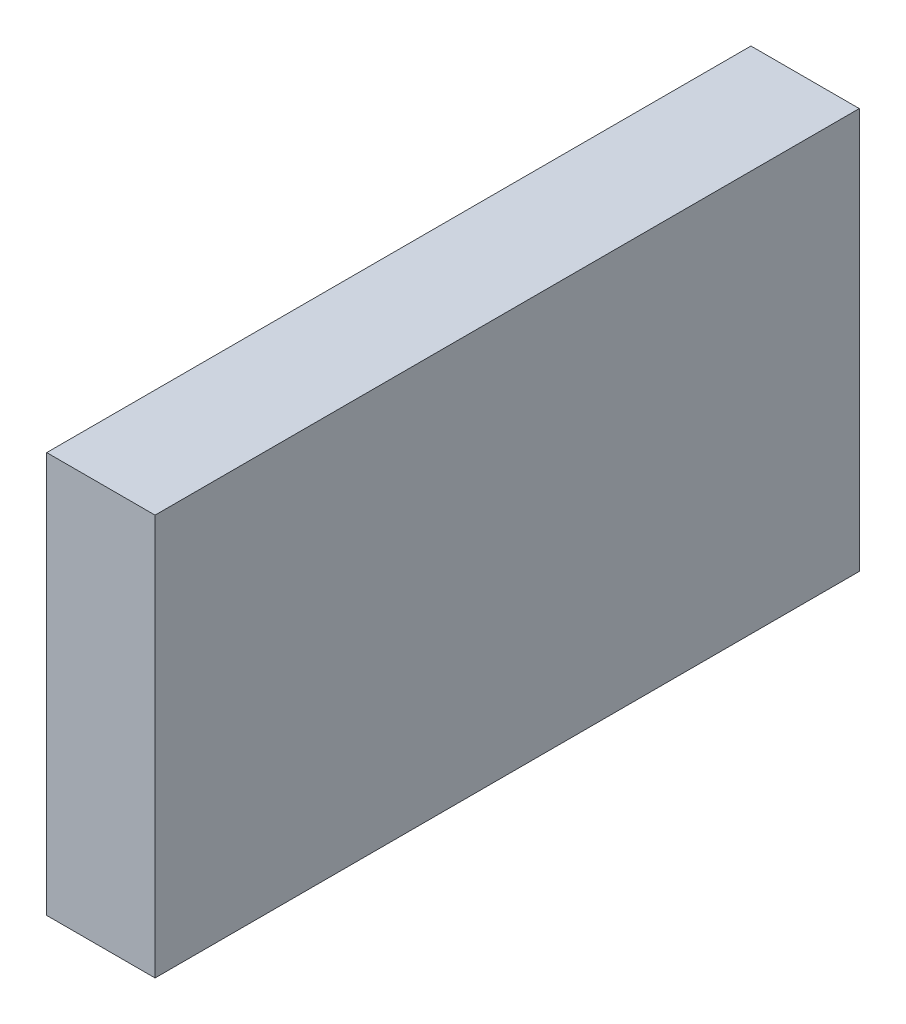
ISO-10303-21;
HEADER;
FILE_DESCRIPTION(('STEP AP214'),'2;1');
FILE_NAME('part.step','',(''),(''),'','','');
FILE_SCHEMA(('AUTOMOTIVE_DESIGN { 1 0 10303 214 1 1 1 1 }'));
ENDSEC;
DATA;
#1=APPLICATION_CONTEXT('core data for automotive mechanical design processes');
#2=APPLICATION_PROTOCOL_DEFINITION('international standard','automotive_design',2000,#1);
#3=PRODUCT_CONTEXT('',#1,'mechanical');
#4=PRODUCT('Part','Part','',(#3));
#5=PRODUCT_RELATED_PRODUCT_CATEGORY('part','',(#4));
#6=PRODUCT_DEFINITION_FORMATION('','',#4);
#7=PRODUCT_DEFINITION_CONTEXT('part definition',#1,'design');
#8=PRODUCT_DEFINITION('design','',#6,#7);
#9=PRODUCT_DEFINITION_SHAPE('','',#8);
#10=(LENGTH_UNIT() NAMED_UNIT(*) SI_UNIT(.MILLI.,.METRE.));
#11=(NAMED_UNIT(*) PLANE_ANGLE_UNIT() SI_UNIT($,.RADIAN.));
#12=(NAMED_UNIT(*) SI_UNIT($,.STERADIAN.) SOLID_ANGLE_UNIT());
#13=UNCERTAINTY_MEASURE_WITH_UNIT(LENGTH_MEASURE(1.E-05),#10,'distance_accuracy_value','');
#14=(GEOMETRIC_REPRESENTATION_CONTEXT(3) GLOBAL_UNCERTAINTY_ASSIGNED_CONTEXT((#13)) GLOBAL_UNIT_ASSIGNED_CONTEXT((#10,
#11,#12)) REPRESENTATION_CONTEXT('',''));
#15=CARTESIAN_POINT('',(0.,0.,0.));
#16=DIRECTION('',(0.,0.,1.));
#17=DIRECTION('',(1.,0.,0.));
#18=AXIS2_PLACEMENT_3D('',#15,#16,#17);
#19=CARTESIAN_POINT('',(0.,0.,33.02));
#20=DIRECTION('',(1.,0.,0.));
#21=DIRECTION('',(0.,0.,-1.));
#22=AXIS2_PLACEMENT_3D('',#19,#20,#21);
#23=PLANE('',#22);
#24=DIRECTION('',(0.,-1.,0.));
#25=VECTOR('',#24,1.);
#26=CARTESIAN_POINT('',(0.,0.,0.));
#27=LINE('',#26,#25);
#28=CARTESIAN_POINT('',(0.,18.796,0.));
#29=VERTEX_POINT('',#28);
#30=CARTESIAN_POINT('',(0.,0.,0.));
#31=VERTEX_POINT('',#30);
#32=EDGE_CURVE('E100',#29,#31,#27,.T.);
#33=ORIENTED_EDGE('',*,*,#32,.T.);
#34=DIRECTION('',(0.,0.,-1.));
#35=VECTOR('',#34,1.);
#36=CARTESIAN_POINT('',(0.,0.,33.02));
#37=LINE('',#36,#35);
#38=CARTESIAN_POINT('',(0.,0.,33.02));
#39=VERTEX_POINT('',#38);
#40=EDGE_CURVE('E11',#39,#31,#37,.T.);
#41=ORIENTED_EDGE('',*,*,#40,.F.);
#42=DIRECTION('',(0.,-1.,0.));
#43=VECTOR('',#42,1.);
#44=CARTESIAN_POINT('',(0.,0.,33.02));
#45=LINE('',#44,#43);
#46=CARTESIAN_POINT('',(0.,18.796,33.02));
#47=VERTEX_POINT('',#46);
#48=EDGE_CURVE('E88',#47,#39,#45,.T.);
#49=ORIENTED_EDGE('',*,*,#48,.F.);
#50=DIRECTION('',(0.,0.,-1.));
#51=VECTOR('',#50,1.);
#52=CARTESIAN_POINT('',(0.,18.796,33.02));
#53=LINE('',#52,#51);
#54=EDGE_CURVE('E96',#47,#29,#53,.T.);
#55=ORIENTED_EDGE('',*,*,#54,.T.);
#56=EDGE_LOOP('',(#33,#41,#49,#55));
#57=FACE_BOUND('',#56,.T.);
#58=ADVANCED_FACE('F37',(#57),#23,.F.);
#59=CARTESIAN_POINT('',(0.,0.,33.02));
#60=DIRECTION('',(0.,1.,0.));
#61=DIRECTION('',(0.,0.,1.));
#62=AXIS2_PLACEMENT_3D('',#59,#60,#61);
#63=PLANE('',#62);
#64=DIRECTION('',(1.,0.,0.));
#65=VECTOR('',#64,1.);
#66=CARTESIAN_POINT('',(0.,0.,0.));
#67=LINE('',#66,#65);
#68=CARTESIAN_POINT('',(5.08,0.,0.));
#69=VERTEX_POINT('',#68);
#70=EDGE_CURVE('E92',#31,#69,#67,.T.);
#71=ORIENTED_EDGE('',*,*,#70,.T.);
#72=DIRECTION('',(0.,0.,-1.));
#73=VECTOR('',#72,1.);
#74=CARTESIAN_POINT('',(5.08,0.,33.02));
#75=LINE('',#74,#73);
#76=CARTESIAN_POINT('',(5.08,0.,33.02));
#77=VERTEX_POINT('',#76);
#78=EDGE_CURVE('E45',#77,#69,#75,.T.);
#79=ORIENTED_EDGE('',*,*,#78,.F.);
#80=DIRECTION('',(1.,0.,0.));
#81=VECTOR('',#80,1.);
#82=CARTESIAN_POINT('',(0.,0.,33.02));
#83=LINE('',#82,#81);
#84=EDGE_CURVE('E83',#39,#77,#83,.T.);
#85=ORIENTED_EDGE('',*,*,#84,.F.);
#86=ORIENTED_EDGE('',*,*,#40,.T.);
#87=EDGE_LOOP('',(#71,#79,#85,#86));
#88=FACE_BOUND('',#87,.T.);
#89=ADVANCED_FACE('F91',(#88),#63,.F.);
#90=CARTESIAN_POINT('',(5.08,0.,33.02));
#91=DIRECTION('',(-1.,0.,0.));
#92=DIRECTION('',(0.,0.,1.));
#93=AXIS2_PLACEMENT_3D('',#90,#91,#92);
#94=PLANE('',#93);
#95=DIRECTION('',(0.,1.,0.));
#96=VECTOR('',#95,1.);
#97=CARTESIAN_POINT('',(5.08,0.,0.));
#98=LINE('',#97,#96);
#99=CARTESIAN_POINT('',(5.08,18.796,0.));
#100=VERTEX_POINT('',#99);
#101=EDGE_CURVE('E70',#69,#100,#98,.T.);
#102=ORIENTED_EDGE('',*,*,#101,.T.);
#103=DIRECTION('',(0.,0.,-1.));
#104=VECTOR('',#103,1.);
#105=CARTESIAN_POINT('',(5.08,18.796,33.02));
#106=LINE('',#105,#104);
#107=CARTESIAN_POINT('',(5.08,18.796,33.02));
#108=VERTEX_POINT('',#107);
#109=EDGE_CURVE('E93',#108,#100,#106,.T.);
#110=ORIENTED_EDGE('',*,*,#109,.F.);
#111=DIRECTION('',(0.,1.,0.));
#112=VECTOR('',#111,1.);
#113=CARTESIAN_POINT('',(5.08,0.,33.02));
#114=LINE('',#113,#112);
#115=EDGE_CURVE('E86',#77,#108,#114,.T.);
#116=ORIENTED_EDGE('',*,*,#115,.F.);
#117=ORIENTED_EDGE('',*,*,#78,.T.);
#118=EDGE_LOOP('',(#102,#110,#116,#117));
#119=FACE_BOUND('',#118,.T.);
#120=ADVANCED_FACE('F94',(#119),#94,.F.);
#121=CARTESIAN_POINT('',(0.,18.796,33.02));
#122=DIRECTION('',(0.,-1.,0.));
#123=DIRECTION('',(0.,0.,-1.));
#124=AXIS2_PLACEMENT_3D('',#121,#122,#123);
#125=PLANE('',#124);
#126=DIRECTION('',(-1.,0.,0.));
#127=VECTOR('',#126,1.);
#128=CARTESIAN_POINT('',(0.,18.796,0.));
#129=LINE('',#128,#127);
#130=EDGE_CURVE('E76',#100,#29,#129,.T.);
#131=ORIENTED_EDGE('',*,*,#130,.T.);
#132=ORIENTED_EDGE('',*,*,#54,.F.);
#133=DIRECTION('',(-1.,0.,0.));
#134=VECTOR('',#133,1.);
#135=CARTESIAN_POINT('',(0.,18.796,33.02));
#136=LINE('',#135,#134);
#137=EDGE_CURVE('E53',#108,#47,#136,.T.);
#138=ORIENTED_EDGE('',*,*,#137,.F.);
#139=ORIENTED_EDGE('',*,*,#109,.T.);
#140=EDGE_LOOP('',(#131,#132,#138,#139));
#141=FACE_BOUND('',#140,.T.);
#142=ADVANCED_FACE('F107',(#141),#125,.F.);
#143=CARTESIAN_POINT('',(0.,0.,33.02));
#144=DIRECTION('',(0.,0.,-1.));
#145=DIRECTION('',(-1.,0.,0.));
#146=AXIS2_PLACEMENT_3D('',#143,#144,#145);
#147=PLANE('',#146);
#148=ORIENTED_EDGE('',*,*,#48,.T.);
#149=ORIENTED_EDGE('',*,*,#84,.T.);
#150=ORIENTED_EDGE('',*,*,#115,.T.);
#151=ORIENTED_EDGE('',*,*,#137,.T.);
#152=EDGE_LOOP('',(#148,#149,#150,#151));
#153=FACE_BOUND('',#152,.T.);
#154=ADVANCED_FACE('F84',(#153),#147,.F.);
#155=CARTESIAN_POINT('',(0.,0.,0.));
#156=DIRECTION('',(0.,0.,-1.));
#157=DIRECTION('',(-1.,0.,0.));
#158=AXIS2_PLACEMENT_3D('',#155,#156,#157);
#159=PLANE('',#158);
#160=ORIENTED_EDGE('',*,*,#32,.F.);
#161=ORIENTED_EDGE('',*,*,#130,.F.);
#162=ORIENTED_EDGE('',*,*,#101,.F.);
#163=ORIENTED_EDGE('',*,*,#70,.F.);
#164=EDGE_LOOP('',(#160,#161,#162,#163));
#165=FACE_BOUND('',#164,.T.);
#166=ADVANCED_FACE('F110',(#165),#159,.T.);
#167=CLOSED_SHELL('',(#58,#89,#120,#142,#154,#166));
#168=MANIFOLD_SOLID_BREP('B2',#167);
#169=ADVANCED_BREP_SHAPE_REPRESENTATION('',(#18,#168),#14);
#170=SHAPE_DEFINITION_REPRESENTATION(#9,#169);
ENDSEC;
END-ISO-10303-21;
